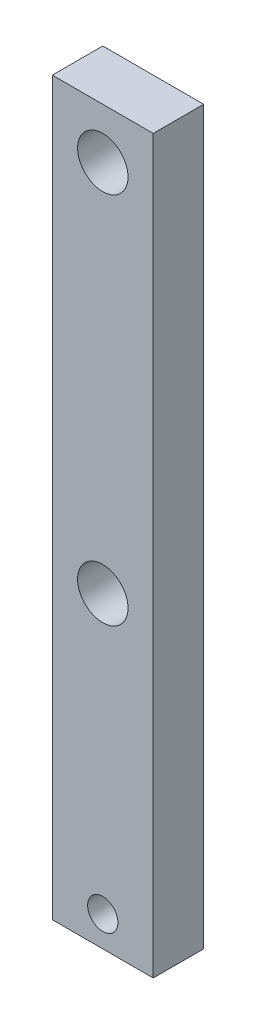
ISO-10303-21;
HEADER;
FILE_DESCRIPTION(('STEP AP214'),'2;1');
FILE_NAME('part.step','',(''),(''),'','','');
FILE_SCHEMA(('AUTOMOTIVE_DESIGN { 1 0 10303 214 1 1 1 1 }'));
ENDSEC;
DATA;
#1=APPLICATION_CONTEXT('core data for automotive mechanical design processes');
#2=APPLICATION_PROTOCOL_DEFINITION('international standard','automotive_design',2000,#1);
#3=PRODUCT_CONTEXT('',#1,'mechanical');
#4=PRODUCT('Part','Part','',(#3));
#5=PRODUCT_RELATED_PRODUCT_CATEGORY('part','',(#4));
#6=PRODUCT_DEFINITION_FORMATION('','',#4);
#7=PRODUCT_DEFINITION_CONTEXT('part definition',#1,'design');
#8=PRODUCT_DEFINITION('design','',#6,#7);
#9=PRODUCT_DEFINITION_SHAPE('','',#8);
#10=(LENGTH_UNIT() NAMED_UNIT(*) SI_UNIT(.MILLI.,.METRE.));
#11=(NAMED_UNIT(*) PLANE_ANGLE_UNIT() SI_UNIT($,.RADIAN.));
#12=(NAMED_UNIT(*) SI_UNIT($,.STERADIAN.) SOLID_ANGLE_UNIT());
#13=UNCERTAINTY_MEASURE_WITH_UNIT(LENGTH_MEASURE(1.E-05),#10,'distance_accuracy_value','');
#14=(GEOMETRIC_REPRESENTATION_CONTEXT(3) GLOBAL_UNCERTAINTY_ASSIGNED_CONTEXT((#13)) GLOBAL_UNIT_ASSIGNED_CONTEXT((#10,
#11,#12)) REPRESENTATION_CONTEXT('',''));
#15=CARTESIAN_POINT('',(0.,0.,0.));
#16=DIRECTION('',(0.,0.,1.));
#17=DIRECTION('',(1.,0.,0.));
#18=AXIS2_PLACEMENT_3D('',#15,#16,#17);
#19=CARTESIAN_POINT('',(-10.,72.5,5.));
#20=DIRECTION('',(1.,0.,0.));
#21=DIRECTION('',(0.,1.,0.));
#22=AXIS2_PLACEMENT_3D('',#19,#20,#21);
#23=PLANE('',#22);
#24=DIRECTION('',(0.,-1.,0.));
#25=VECTOR('',#24,1.);
#26=CARTESIAN_POINT('',(-10.,72.5,0.));
#27=LINE('',#26,#25);
#28=CARTESIAN_POINT('',(-10.,72.5,0.));
#29=VERTEX_POINT('',#28);
#30=CARTESIAN_POINT('',(-9.99999999999999,0.,0.));
#31=VERTEX_POINT('',#30);
#32=EDGE_CURVE('E122',#29,#31,#27,.T.);
#33=ORIENTED_EDGE('',*,*,#32,.T.);
#34=DIRECTION('',(0.,0.,-1.));
#35=VECTOR('',#34,1.);
#36=CARTESIAN_POINT('',(-9.99999999999999,0.,5.));
#37=LINE('',#36,#35);
#38=CARTESIAN_POINT('',(-9.99999999999999,0.,5.));
#39=VERTEX_POINT('',#38);
#40=EDGE_CURVE('E12',#39,#31,#37,.T.);
#41=ORIENTED_EDGE('',*,*,#40,.F.);
#42=DIRECTION('',(0.,-1.,0.));
#43=VECTOR('',#42,1.);
#44=CARTESIAN_POINT('',(-10.,72.5,5.));
#45=LINE('',#44,#43);
#46=CARTESIAN_POINT('',(-10.,72.5,5.));
#47=VERTEX_POINT('',#46);
#48=EDGE_CURVE('E89',#47,#39,#45,.T.);
#49=ORIENTED_EDGE('',*,*,#48,.F.);
#50=DIRECTION('',(0.,0.,-1.));
#51=VECTOR('',#50,1.);
#52=CARTESIAN_POINT('',(-10.,72.5,5.));
#53=LINE('',#52,#51);
#54=EDGE_CURVE('E100',#47,#29,#53,.T.);
#55=ORIENTED_EDGE('',*,*,#54,.T.);
#56=EDGE_LOOP('',(#33,#41,#49,#55));
#57=FACE_BOUND('',#56,.T.);
#58=ADVANCED_FACE('F38',(#57),#23,.F.);
#59=CARTESIAN_POINT('',(-9.99999999999999,0.,5.));
#60=DIRECTION('',(0.,1.,0.));
#61=DIRECTION('',(0.,0.,1.));
#62=AXIS2_PLACEMENT_3D('',#59,#60,#61);
#63=PLANE('',#62);
#64=DIRECTION('',(1.,0.,0.));
#65=VECTOR('',#64,1.);
#66=CARTESIAN_POINT('',(-9.99999999999999,0.,0.));
#67=LINE('',#66,#65);
#68=CARTESIAN_POINT('',(0.,0.,0.));
#69=VERTEX_POINT('',#68);
#70=EDGE_CURVE('E94',#31,#69,#67,.T.);
#71=ORIENTED_EDGE('',*,*,#70,.T.);
#72=DIRECTION('',(0.,0.,-1.));
#73=VECTOR('',#72,1.);
#74=CARTESIAN_POINT('',(0.,0.,5.));
#75=LINE('',#74,#73);
#76=CARTESIAN_POINT('',(0.,0.,5.));
#77=VERTEX_POINT('',#76);
#78=EDGE_CURVE('E46',#77,#69,#75,.T.);
#79=ORIENTED_EDGE('',*,*,#78,.F.);
#80=DIRECTION('',(1.,0.,0.));
#81=VECTOR('',#80,1.);
#82=CARTESIAN_POINT('',(-9.99999999999999,0.,5.));
#83=LINE('',#82,#81);
#84=EDGE_CURVE('E84',#39,#77,#83,.T.);
#85=ORIENTED_EDGE('',*,*,#84,.F.);
#86=ORIENTED_EDGE('',*,*,#40,.T.);
#87=EDGE_LOOP('',(#71,#79,#85,#86));
#88=FACE_BOUND('',#87,.T.);
#89=ADVANCED_FACE('F93',(#88),#63,.F.);
#90=CARTESIAN_POINT('',(0.,72.5,5.));
#91=DIRECTION('',(-1.,0.,0.));
#92=DIRECTION('',(0.,-1.,0.));
#93=AXIS2_PLACEMENT_3D('',#90,#91,#92);
#94=PLANE('',#93);
#95=DIRECTION('',(0.,1.,0.));
#96=VECTOR('',#95,1.);
#97=CARTESIAN_POINT('',(0.,72.5,0.));
#98=LINE('',#97,#96);
#99=CARTESIAN_POINT('',(0.,72.5,0.));
#100=VERTEX_POINT('',#99);
#101=EDGE_CURVE('E71',#69,#100,#98,.T.);
#102=ORIENTED_EDGE('',*,*,#101,.T.);
#103=DIRECTION('',(0.,0.,-1.));
#104=VECTOR('',#103,1.);
#105=CARTESIAN_POINT('',(0.,72.5,5.));
#106=LINE('',#105,#104);
#107=CARTESIAN_POINT('',(0.,72.5,5.));
#108=VERTEX_POINT('',#107);
#109=EDGE_CURVE('E95',#108,#100,#106,.T.);
#110=ORIENTED_EDGE('',*,*,#109,.F.);
#111=DIRECTION('',(0.,1.,0.));
#112=VECTOR('',#111,1.);
#113=CARTESIAN_POINT('',(0.,72.5,5.));
#114=LINE('',#113,#112);
#115=EDGE_CURVE('E87',#77,#108,#114,.T.);
#116=ORIENTED_EDGE('',*,*,#115,.F.);
#117=ORIENTED_EDGE('',*,*,#78,.T.);
#118=EDGE_LOOP('',(#102,#110,#116,#117));
#119=FACE_BOUND('',#118,.T.);
#120=ADVANCED_FACE('F96',(#119),#94,.F.);
#121=CARTESIAN_POINT('',(-10.,72.5,5.));
#122=DIRECTION('',(0.,-1.,0.));
#123=DIRECTION('',(0.,0.,-1.));
#124=AXIS2_PLACEMENT_3D('',#121,#122,#123);
#125=PLANE('',#124);
#126=DIRECTION('',(-1.,0.,0.));
#127=VECTOR('',#126,1.);
#128=CARTESIAN_POINT('',(-10.,72.5,0.));
#129=LINE('',#128,#127);
#130=EDGE_CURVE('E77',#100,#29,#129,.T.);
#131=ORIENTED_EDGE('',*,*,#130,.T.);
#132=ORIENTED_EDGE('',*,*,#54,.F.);
#133=DIRECTION('',(-1.,0.,0.));
#134=VECTOR('',#133,1.);
#135=CARTESIAN_POINT('',(-10.,72.5,5.));
#136=LINE('',#135,#134);
#137=EDGE_CURVE('E54',#108,#47,#136,.T.);
#138=ORIENTED_EDGE('',*,*,#137,.F.);
#139=ORIENTED_EDGE('',*,*,#109,.T.);
#140=EDGE_LOOP('',(#131,#132,#138,#139));
#141=FACE_BOUND('',#140,.T.);
#142=ADVANCED_FACE('F151',(#141),#125,.F.);
#143=CARTESIAN_POINT('',(0.,0.,5.));
#144=DIRECTION('',(0.,0.,1.));
#145=DIRECTION('',(1.,0.,0.));
#146=AXIS2_PLACEMENT_3D('',#143,#144,#145);
#147=PLANE('',#146);
#148=CARTESIAN_POINT('',(-5.,3.,5.));
#149=DIRECTION('',(0.,0.,1.));
#150=DIRECTION('',(1.,0.,0.));
#151=AXIS2_PLACEMENT_3D('',#148,#149,#150);
#152=CIRCLE('',#151,1.5);
#153=CARTESIAN_POINT('',(-3.5,3.,5.));
#154=VERTEX_POINT('',#153);
#155=EDGE_CURVE('E131',#154,#154,#152,.T.);
#156=ORIENTED_EDGE('',*,*,#155,.F.);
#157=EDGE_LOOP('',(#156));
#158=FACE_BOUND('',#157,.T.);
#159=CARTESIAN_POINT('',(-5.,30.5,5.));
#160=DIRECTION('',(0.,0.,1.));
#161=DIRECTION('',(1.,0.,0.));
#162=AXIS2_PLACEMENT_3D('',#159,#160,#161);
#163=CIRCLE('',#162,2.5);
#164=CARTESIAN_POINT('',(-2.5,30.5,5.));
#165=VERTEX_POINT('',#164);
#166=EDGE_CURVE('E123',#165,#165,#163,.T.);
#167=ORIENTED_EDGE('',*,*,#166,.F.);
#168=EDGE_LOOP('',(#167));
#169=FACE_BOUND('',#168,.T.);
#170=CARTESIAN_POINT('',(-5.,67.5,5.));
#171=DIRECTION('',(0.,0.,1.));
#172=DIRECTION('',(1.,0.,0.));
#173=AXIS2_PLACEMENT_3D('',#170,#171,#172);
#174=CIRCLE('',#173,2.5);
#175=CARTESIAN_POINT('',(-2.5,67.5,5.));
#176=VERTEX_POINT('',#175);
#177=EDGE_CURVE('E113',#176,#176,#174,.T.);
#178=ORIENTED_EDGE('',*,*,#177,.F.);
#179=EDGE_LOOP('',(#178));
#180=FACE_BOUND('',#179,.T.);
#181=ORIENTED_EDGE('',*,*,#48,.T.);
#182=ORIENTED_EDGE('',*,*,#84,.T.);
#183=ORIENTED_EDGE('',*,*,#115,.T.);
#184=ORIENTED_EDGE('',*,*,#137,.T.);
#185=EDGE_LOOP('',(#181,#182,#183,#184));
#186=FACE_BOUND('',#185,.T.);
#187=ADVANCED_FACE('F85',(#158,#169,#180,#186),#147,.T.);
#188=CARTESIAN_POINT('',(0.,0.,0.));
#189=DIRECTION('',(0.,0.,1.));
#190=DIRECTION('',(1.,0.,0.));
#191=AXIS2_PLACEMENT_3D('',#188,#189,#190);
#192=PLANE('',#191);
#193=CARTESIAN_POINT('',(-5.,3.,0.));
#194=DIRECTION('',(0.,0.,1.));
#195=DIRECTION('',(1.,0.,0.));
#196=AXIS2_PLACEMENT_3D('',#193,#194,#195);
#197=CIRCLE('',#196,1.5);
#198=CARTESIAN_POINT('',(-3.5,3.,0.));
#199=VERTEX_POINT('',#198);
#200=EDGE_CURVE('E119',#199,#199,#197,.T.);
#201=ORIENTED_EDGE('',*,*,#200,.T.);
#202=EDGE_LOOP('',(#201));
#203=FACE_BOUND('',#202,.T.);
#204=CARTESIAN_POINT('',(-5.,30.5,0.));
#205=DIRECTION('',(0.,0.,1.));
#206=DIRECTION('',(1.,0.,0.));
#207=AXIS2_PLACEMENT_3D('',#204,#205,#206);
#208=CIRCLE('',#207,2.5);
#209=CARTESIAN_POINT('',(-2.5,30.5,0.));
#210=VERTEX_POINT('',#209);
#211=EDGE_CURVE('E128',#210,#210,#208,.T.);
#212=ORIENTED_EDGE('',*,*,#211,.T.);
#213=EDGE_LOOP('',(#212));
#214=FACE_BOUND('',#213,.T.);
#215=CARTESIAN_POINT('',(-5.,67.5,0.));
#216=DIRECTION('',(0.,0.,1.));
#217=DIRECTION('',(1.,0.,0.));
#218=AXIS2_PLACEMENT_3D('',#215,#216,#217);
#219=CIRCLE('',#218,2.5);
#220=CARTESIAN_POINT('',(-2.5,67.5,0.));
#221=VERTEX_POINT('',#220);
#222=EDGE_CURVE('E118',#221,#221,#219,.T.);
#223=ORIENTED_EDGE('',*,*,#222,.T.);
#224=EDGE_LOOP('',(#223));
#225=FACE_BOUND('',#224,.T.);
#226=ORIENTED_EDGE('',*,*,#32,.F.);
#227=ORIENTED_EDGE('',*,*,#130,.F.);
#228=ORIENTED_EDGE('',*,*,#101,.F.);
#229=ORIENTED_EDGE('',*,*,#70,.F.);
#230=EDGE_LOOP('',(#226,#227,#228,#229));
#231=FACE_BOUND('',#230,.T.);
#232=ADVANCED_FACE('F139',(#203,#214,#225,#231),#192,.F.);
#233=CARTESIAN_POINT('',(-5.,67.5,0.));
#234=DIRECTION('',(0.,0.,1.));
#235=DIRECTION('',(1.,0.,0.));
#236=AXIS2_PLACEMENT_3D('',#233,#234,#235);
#237=CYLINDRICAL_SURFACE('',#236,2.5);
#238=ORIENTED_EDGE('',*,*,#222,.F.);
#239=EDGE_LOOP('',(#238));
#240=FACE_BOUND('',#239,.T.);
#241=ORIENTED_EDGE('',*,*,#177,.T.);
#242=EDGE_LOOP('',(#241));
#243=FACE_BOUND('',#242,.T.);
#244=ADVANCED_FACE('F157',(#240,#243),#237,.F.);
#245=CARTESIAN_POINT('',(-5.,30.5,0.));
#246=DIRECTION('',(0.,0.,1.));
#247=DIRECTION('',(1.,0.,0.));
#248=AXIS2_PLACEMENT_3D('',#245,#246,#247);
#249=CYLINDRICAL_SURFACE('',#248,2.5);
#250=ORIENTED_EDGE('',*,*,#211,.F.);
#251=EDGE_LOOP('',(#250));
#252=FACE_BOUND('',#251,.T.);
#253=ORIENTED_EDGE('',*,*,#166,.T.);
#254=EDGE_LOOP('',(#253));
#255=FACE_BOUND('',#254,.T.);
#256=ADVANCED_FACE('F145',(#252,#255),#249,.F.);
#257=CARTESIAN_POINT('',(-5.,3.,0.));
#258=DIRECTION('',(0.,0.,1.));
#259=DIRECTION('',(1.,0.,0.));
#260=AXIS2_PLACEMENT_3D('',#257,#258,#259);
#261=CYLINDRICAL_SURFACE('',#260,1.5);
#262=ORIENTED_EDGE('',*,*,#200,.F.);
#263=EDGE_LOOP('',(#262));
#264=FACE_BOUND('',#263,.T.);
#265=ORIENTED_EDGE('',*,*,#155,.T.);
#266=EDGE_LOOP('',(#265));
#267=FACE_BOUND('',#266,.T.);
#268=ADVANCED_FACE('F142',(#264,#267),#261,.F.);
#269=CLOSED_SHELL('',(#58,#89,#120,#142,#187,#232,#244,#256,#268));
#270=MANIFOLD_SOLID_BREP('B2',#269);
#271=ADVANCED_BREP_SHAPE_REPRESENTATION('',(#18,#270),#14);
#272=SHAPE_DEFINITION_REPRESENTATION(#9,#271);
ENDSEC;
END-ISO-10303-21;
